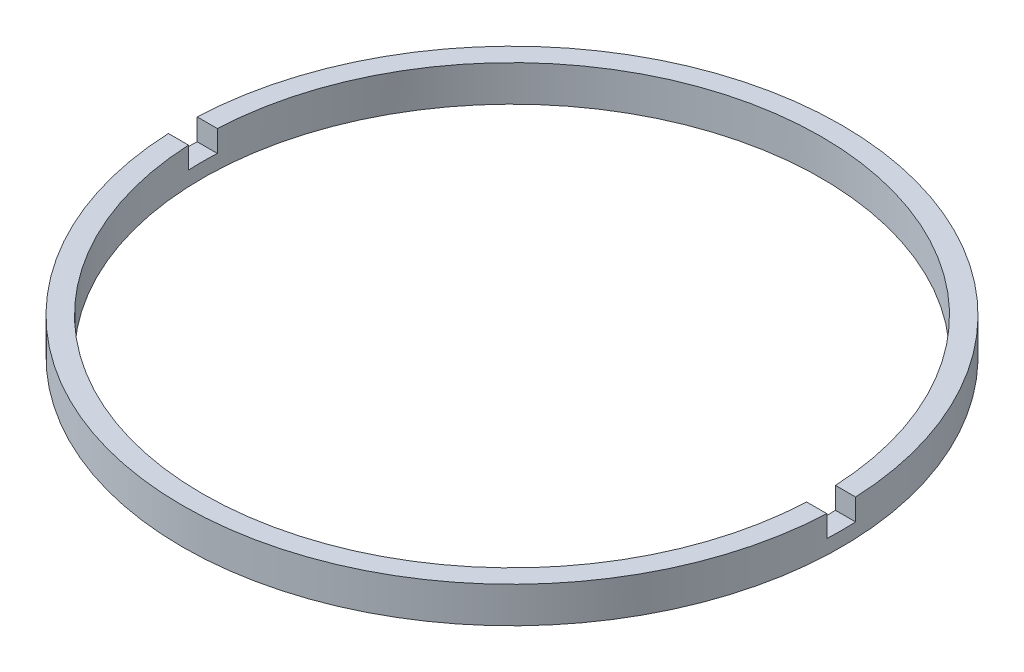
ISO-10303-21;
HEADER;
FILE_DESCRIPTION(('STEP AP214'),'2;1');
FILE_NAME('part.step','',(''),(''),'','','');
FILE_SCHEMA(('AUTOMOTIVE_DESIGN { 1 0 10303 214 1 1 1 1 }'));
ENDSEC;
DATA;
#1=APPLICATION_CONTEXT('core data for automotive mechanical design processes');
#2=APPLICATION_PROTOCOL_DEFINITION('international standard','automotive_design',2000,#1);
#3=PRODUCT_CONTEXT('',#1,'mechanical');
#4=PRODUCT('Part','Part','',(#3));
#5=PRODUCT_RELATED_PRODUCT_CATEGORY('part','',(#4));
#6=PRODUCT_DEFINITION_FORMATION('','',#4);
#7=PRODUCT_DEFINITION_CONTEXT('part definition',#1,'design');
#8=PRODUCT_DEFINITION('design','',#6,#7);
#9=PRODUCT_DEFINITION_SHAPE('','',#8);
#10=(LENGTH_UNIT() NAMED_UNIT(*) SI_UNIT(.MILLI.,.METRE.));
#11=(NAMED_UNIT(*) PLANE_ANGLE_UNIT() SI_UNIT($,.RADIAN.));
#12=(NAMED_UNIT(*) SI_UNIT($,.STERADIAN.) SOLID_ANGLE_UNIT());
#13=UNCERTAINTY_MEASURE_WITH_UNIT(LENGTH_MEASURE(1.E-05),#10,'distance_accuracy_value','');
#14=(GEOMETRIC_REPRESENTATION_CONTEXT(3) GLOBAL_UNCERTAINTY_ASSIGNED_CONTEXT((#13)) GLOBAL_UNIT_ASSIGNED_CONTEXT((#10,
#11,#12)) REPRESENTATION_CONTEXT('',''));
#15=CARTESIAN_POINT('',(0.,0.,0.));
#16=DIRECTION('',(0.,0.,1.));
#17=DIRECTION('',(1.,0.,0.));
#18=AXIS2_PLACEMENT_3D('',#15,#16,#17);
#19=CARTESIAN_POINT('',(21.5,-1.96424978717943,0.));
#20=DIRECTION('',(0.,-1.,0.));
#21=DIRECTION('',(0.,0.,-1.));
#22=AXIS2_PLACEMENT_3D('',#19,#20,#21);
#23=PLANE('',#22);
#24=CARTESIAN_POINT('',(0.,-1.96424978717943,0.));
#25=DIRECTION('',(0.,1.,0.));
#26=DIRECTION('',(0.,0.,1.));
#27=AXIS2_PLACEMENT_3D('',#24,#25,#26);
#28=CIRCLE('',#27,22.9);
#29=CARTESIAN_POINT('',(-22.8781555200589,-1.96424978717943,1.));
#30=VERTEX_POINT('',#29);
#31=CARTESIAN_POINT('',(22.8781555200589,-1.96424978717943,1.));
#32=VERTEX_POINT('',#31);
#33=EDGE_CURVE('E126',#30,#32,#28,.T.);
#34=ORIENTED_EDGE('',*,*,#33,.T.);
#35=DIRECTION('',(1.,0.,0.));
#36=VECTOR('',#35,1.);
#37=CARTESIAN_POINT('',(-26.8525402726146,-1.96424978717943,1.));
#38=LINE('',#37,#36);
#39=CARTESIAN_POINT('',(21.4767315949145,-1.96424978717943,1.));
#40=VERTEX_POINT('',#39);
#41=EDGE_CURVE('E119',#40,#32,#38,.T.);
#42=ORIENTED_EDGE('',*,*,#41,.F.);
#43=CARTESIAN_POINT('',(0.,-1.96424978717943,0.));
#44=DIRECTION('',(0.,1.,0.));
#45=DIRECTION('',(0.,0.,1.));
#46=AXIS2_PLACEMENT_3D('',#43,#44,#45);
#47=CIRCLE('',#46,21.5);
#48=CARTESIAN_POINT('',(-21.4767315949145,-1.96424978717943,1.));
#49=VERTEX_POINT('',#48);
#50=EDGE_CURVE('E133',#49,#40,#47,.T.);
#51=ORIENTED_EDGE('',*,*,#50,.F.);
#52=EDGE_CURVE('E148',#30,#49,#38,.T.);
#53=ORIENTED_EDGE('',*,*,#52,.F.);
#54=EDGE_LOOP('',(#34,#42,#51,#53));
#55=FACE_BOUND('',#54,.T.);
#56=ADVANCED_FACE('F36',(#55),#23,.F.);
#57=CARTESIAN_POINT('',(0.,56.2608426270136,0.));
#58=DIRECTION('',(0.,1.,0.));
#59=DIRECTION('',(0.,0.,1.));
#60=AXIS2_PLACEMENT_3D('',#57,#58,#59);
#61=CYLINDRICAL_SURFACE('',#60,22.9);
#62=CARTESIAN_POINT('',(0.,-3.46424978717943,0.));
#63=DIRECTION('',(0.,1.,0.));
#64=DIRECTION('',(0.,0.,1.));
#65=AXIS2_PLACEMENT_3D('',#62,#63,#64);
#66=CIRCLE('',#65,22.9);
#67=CARTESIAN_POINT('',(22.8781555200589,-3.46424978717943,1.));
#68=VERTEX_POINT('',#67);
#69=CARTESIAN_POINT('',(22.8781555200589,-3.46424978717943,-1.));
#70=VERTEX_POINT('',#69);
#71=EDGE_CURVE('E109',#68,#70,#66,.T.);
#72=ORIENTED_EDGE('',*,*,#71,.F.);
#73=DIRECTION('',(0.,1.,0.));
#74=VECTOR('',#73,1.);
#75=CARTESIAN_POINT('',(22.8781555200589,56.2608426270136,1.));
#76=LINE('',#75,#74);
#77=EDGE_CURVE('E161',#68,#32,#76,.T.);
#78=ORIENTED_EDGE('',*,*,#77,.T.);
#79=ORIENTED_EDGE('',*,*,#33,.F.);
#80=DIRECTION('',(0.,1.,0.));
#81=VECTOR('',#80,1.);
#82=CARTESIAN_POINT('',(-22.8781555200589,56.2608426270136,1.));
#83=LINE('',#82,#81);
#84=CARTESIAN_POINT('',(-22.8781555200589,-3.46424978717943,1.));
#85=VERTEX_POINT('',#84);
#86=EDGE_CURVE('E158',#30,#85,#83,.F.);
#87=ORIENTED_EDGE('',*,*,#86,.T.);
#88=CARTESIAN_POINT('',(-22.8781555200589,-3.46424978717943,-1.));
#89=VERTEX_POINT('',#88);
#90=EDGE_CURVE('E155',#89,#85,#66,.T.);
#91=ORIENTED_EDGE('',*,*,#90,.F.);
#92=DIRECTION('',(0.,1.,0.));
#93=VECTOR('',#92,1.);
#94=CARTESIAN_POINT('',(-22.8781555200589,56.2608426270136,-1.));
#95=LINE('',#94,#93);
#96=CARTESIAN_POINT('',(-22.8781555200589,-1.96424978717943,-1.));
#97=VERTEX_POINT('',#96);
#98=EDGE_CURVE('E108',#89,#97,#95,.T.);
#99=ORIENTED_EDGE('',*,*,#98,.T.);
#100=CARTESIAN_POINT('',(22.8781555200589,-1.96424978717943,-1.));
#101=VERTEX_POINT('',#100);
#102=EDGE_CURVE('E116',#101,#97,#28,.T.);
#103=ORIENTED_EDGE('',*,*,#102,.F.);
#104=DIRECTION('',(0.,1.,0.));
#105=VECTOR('',#104,1.);
#106=CARTESIAN_POINT('',(22.8781555200589,56.2608426270136,-1.));
#107=LINE('',#106,#105);
#108=EDGE_CURVE('E100',#101,#70,#107,.F.);
#109=ORIENTED_EDGE('',*,*,#108,.T.);
#110=EDGE_LOOP('',(#72,#78,#79,#87,#91,#99,#103,#109));
#111=FACE_BOUND('',#110,.T.);
#112=CARTESIAN_POINT('',(0.,-4.46424978717943,0.));
#113=DIRECTION('',(0.,1.,0.));
#114=DIRECTION('',(0.,0.,1.));
#115=AXIS2_PLACEMENT_3D('',#112,#113,#114);
#116=CIRCLE('',#115,22.9);
#117=CARTESIAN_POINT('',(0.,-4.46424978717943,22.9));
#118=VERTEX_POINT('',#117);
#119=EDGE_CURVE('E164',#118,#118,#116,.T.);
#120=ORIENTED_EDGE('',*,*,#119,.T.);
#121=EDGE_LOOP('',(#120));
#122=FACE_BOUND('',#121,.T.);
#123=ADVANCED_FACE('F38',(#111,#122),#61,.T.);
#124=ORIENTED_EDGE('',*,*,#102,.T.);
#125=DIRECTION('',(-1.,0.,0.));
#126=VECTOR('',#125,1.);
#127=CARTESIAN_POINT('',(-26.8525402726146,-1.96424978717943,-1.));
#128=LINE('',#127,#126);
#129=CARTESIAN_POINT('',(-21.4767315949145,-1.96424978717943,-1.));
#130=VERTEX_POINT('',#129);
#131=EDGE_CURVE('E120',#130,#97,#128,.T.);
#132=ORIENTED_EDGE('',*,*,#131,.F.);
#133=CARTESIAN_POINT('',(21.4767315949145,-1.96424978717943,-1.));
#134=VERTEX_POINT('',#133);
#135=EDGE_CURVE('E118',#134,#130,#47,.T.);
#136=ORIENTED_EDGE('',*,*,#135,.F.);
#137=EDGE_CURVE('E103',#101,#134,#128,.T.);
#138=ORIENTED_EDGE('',*,*,#137,.F.);
#139=EDGE_LOOP('',(#124,#132,#136,#138));
#140=FACE_BOUND('',#139,.T.);
#141=ADVANCED_FACE('F114',(#140),#23,.F.);
#142=CARTESIAN_POINT('',(0.,56.2608426270136,0.));
#143=DIRECTION('',(0.,1.,0.));
#144=DIRECTION('',(0.,0.,1.));
#145=AXIS2_PLACEMENT_3D('',#142,#143,#144);
#146=CYLINDRICAL_SURFACE('',#145,21.5);
#147=CARTESIAN_POINT('',(0.,-3.46424978717943,0.));
#148=DIRECTION('',(0.,1.,0.));
#149=DIRECTION('',(0.,0.,1.));
#150=AXIS2_PLACEMENT_3D('',#147,#148,#149);
#151=CIRCLE('',#150,21.5);
#152=CARTESIAN_POINT('',(-21.4767315949145,-3.46424978717943,1.));
#153=VERTEX_POINT('',#152);
#154=CARTESIAN_POINT('',(-21.4767315949145,-3.46424978717943,-1.));
#155=VERTEX_POINT('',#154);
#156=EDGE_CURVE('E130',#153,#155,#151,.F.);
#157=ORIENTED_EDGE('',*,*,#156,.F.);
#158=DIRECTION('',(0.,1.,0.));
#159=VECTOR('',#158,1.);
#160=CARTESIAN_POINT('',(-21.4767315949145,56.2608426270136,1.));
#161=LINE('',#160,#159);
#162=EDGE_CURVE('E11',#153,#49,#161,.T.);
#163=ORIENTED_EDGE('',*,*,#162,.T.);
#164=ORIENTED_EDGE('',*,*,#50,.T.);
#165=DIRECTION('',(0.,1.,0.));
#166=VECTOR('',#165,1.);
#167=CARTESIAN_POINT('',(21.4767315949145,56.2608426270136,1.));
#168=LINE('',#167,#166);
#169=CARTESIAN_POINT('',(21.4767315949145,-3.46424978717943,1.));
#170=VERTEX_POINT('',#169);
#171=EDGE_CURVE('E137',#40,#170,#168,.F.);
#172=ORIENTED_EDGE('',*,*,#171,.T.);
#173=CARTESIAN_POINT('',(21.4767315949145,-3.46424978717943,-1.));
#174=VERTEX_POINT('',#173);
#175=EDGE_CURVE('E125',#174,#170,#151,.F.);
#176=ORIENTED_EDGE('',*,*,#175,.F.);
#177=DIRECTION('',(0.,1.,0.));
#178=VECTOR('',#177,1.);
#179=CARTESIAN_POINT('',(21.4767315949145,56.2608426270136,-1.));
#180=LINE('',#179,#178);
#181=EDGE_CURVE('E128',#174,#134,#180,.T.);
#182=ORIENTED_EDGE('',*,*,#181,.T.);
#183=ORIENTED_EDGE('',*,*,#135,.T.);
#184=DIRECTION('',(0.,1.,0.));
#185=VECTOR('',#184,1.);
#186=CARTESIAN_POINT('',(-21.4767315949145,56.2608426270136,-1.));
#187=LINE('',#186,#185);
#188=EDGE_CURVE('E44',#130,#155,#187,.F.);
#189=ORIENTED_EDGE('',*,*,#188,.T.);
#190=EDGE_LOOP('',(#157,#163,#164,#172,#176,#182,#183,#189));
#191=FACE_BOUND('',#190,.T.);
#192=CARTESIAN_POINT('',(0.,-4.46424978717943,0.));
#193=DIRECTION('',(0.,1.,0.));
#194=DIRECTION('',(0.,0.,1.));
#195=AXIS2_PLACEMENT_3D('',#192,#193,#194);
#196=CIRCLE('',#195,21.5);
#197=CARTESIAN_POINT('',(0.,-4.46424978717943,21.5));
#198=VERTEX_POINT('',#197);
#199=EDGE_CURVE('E166',#198,#198,#196,.T.);
#200=ORIENTED_EDGE('',*,*,#199,.F.);
#201=EDGE_LOOP('',(#200));
#202=FACE_BOUND('',#201,.T.);
#203=ADVANCED_FACE('F172',(#191,#202),#146,.F.);
#204=CARTESIAN_POINT('',(21.5,-4.46424978717943,0.));
#205=DIRECTION('',(0.,1.,0.));
#206=DIRECTION('',(0.,0.,1.));
#207=AXIS2_PLACEMENT_3D('',#204,#205,#206);
#208=PLANE('',#207);
#209=ORIENTED_EDGE('',*,*,#119,.F.);
#210=EDGE_LOOP('',(#209));
#211=FACE_BOUND('',#210,.T.);
#212=ORIENTED_EDGE('',*,*,#199,.T.);
#213=EDGE_LOOP('',(#212));
#214=FACE_BOUND('',#213,.T.);
#215=ADVANCED_FACE('F202',(#211,#214),#208,.F.);
#216=CARTESIAN_POINT('',(0.,-3.46424978717943,0.));
#217=DIRECTION('',(0.,1.,0.));
#218=DIRECTION('',(0.,0.,1.));
#219=AXIS2_PLACEMENT_3D('',#216,#217,#218);
#220=PLANE('',#219);
#221=ORIENTED_EDGE('',*,*,#71,.T.);
#222=DIRECTION('',(-1.,0.,0.));
#223=VECTOR('',#222,1.);
#224=CARTESIAN_POINT('',(-26.8525402726146,-3.46424978717943,-1.));
#225=LINE('',#224,#223);
#226=EDGE_CURVE('E59',#70,#174,#225,.T.);
#227=ORIENTED_EDGE('',*,*,#226,.T.);
#228=ORIENTED_EDGE('',*,*,#175,.T.);
#229=DIRECTION('',(1.,0.,0.));
#230=VECTOR('',#229,1.);
#231=CARTESIAN_POINT('',(-26.8525402726146,-3.46424978717943,1.));
#232=LINE('',#231,#230);
#233=EDGE_CURVE('E150',#170,#68,#232,.T.);
#234=ORIENTED_EDGE('',*,*,#233,.T.);
#235=EDGE_LOOP('',(#221,#227,#228,#234));
#236=FACE_BOUND('',#235,.T.);
#237=ADVANCED_FACE('F176',(#236),#220,.T.);
#238=CARTESIAN_POINT('',(-26.8525402726146,-3.46424978717943,-1.));
#239=DIRECTION('',(0.,0.,-1.));
#240=DIRECTION('',(-1.,0.,0.));
#241=AXIS2_PLACEMENT_3D('',#238,#239,#240);
#242=PLANE('',#241);
#243=ORIENTED_EDGE('',*,*,#137,.T.);
#244=ORIENTED_EDGE('',*,*,#181,.F.);
#245=ORIENTED_EDGE('',*,*,#226,.F.);
#246=ORIENTED_EDGE('',*,*,#108,.F.);
#247=EDGE_LOOP('',(#243,#244,#245,#246));
#248=FACE_BOUND('',#247,.T.);
#249=ADVANCED_FACE('F102',(#248),#242,.F.);
#250=CARTESIAN_POINT('',(-26.8525402726146,-3.46424978717943,1.));
#251=DIRECTION('',(0.,0.,1.));
#252=DIRECTION('',(1.,0.,0.));
#253=AXIS2_PLACEMENT_3D('',#250,#251,#252);
#254=PLANE('',#253);
#255=ORIENTED_EDGE('',*,*,#233,.F.);
#256=ORIENTED_EDGE('',*,*,#171,.F.);
#257=ORIENTED_EDGE('',*,*,#41,.T.);
#258=ORIENTED_EDGE('',*,*,#77,.F.);
#259=EDGE_LOOP('',(#255,#256,#257,#258));
#260=FACE_BOUND('',#259,.T.);
#261=ADVANCED_FACE('F178',(#260),#254,.F.);
#262=ORIENTED_EDGE('',*,*,#52,.T.);
#263=ORIENTED_EDGE('',*,*,#162,.F.);
#264=EDGE_CURVE('E51',#85,#153,#232,.T.);
#265=ORIENTED_EDGE('',*,*,#264,.F.);
#266=ORIENTED_EDGE('',*,*,#86,.F.);
#267=EDGE_LOOP('',(#262,#263,#265,#266));
#268=FACE_BOUND('',#267,.T.);
#269=ADVANCED_FACE('F184',(#268),#254,.F.);
#270=EDGE_CURVE('E145',#155,#89,#225,.T.);
#271=ORIENTED_EDGE('',*,*,#270,.F.);
#272=ORIENTED_EDGE('',*,*,#188,.F.);
#273=ORIENTED_EDGE('',*,*,#131,.T.);
#274=ORIENTED_EDGE('',*,*,#98,.F.);
#275=EDGE_LOOP('',(#271,#272,#273,#274));
#276=FACE_BOUND('',#275,.T.);
#277=ADVANCED_FACE('F147',(#276),#242,.F.);
#278=ORIENTED_EDGE('',*,*,#90,.T.);
#279=ORIENTED_EDGE('',*,*,#264,.T.);
#280=ORIENTED_EDGE('',*,*,#156,.T.);
#281=ORIENTED_EDGE('',*,*,#270,.T.);
#282=EDGE_LOOP('',(#278,#279,#280,#281));
#283=FACE_BOUND('',#282,.T.);
#284=ADVANCED_FACE('F144',(#283),#220,.T.);
#285=CLOSED_SHELL('',(#56,#123,#141,#203,#215,#237,#249,#261,#269,#277,#284));
#286=MANIFOLD_SOLID_BREP('B2',#285);
#287=ADVANCED_BREP_SHAPE_REPRESENTATION('',(#18,#286),#14);
#288=SHAPE_DEFINITION_REPRESENTATION(#9,#287);
ENDSEC;
END-ISO-10303-21;
